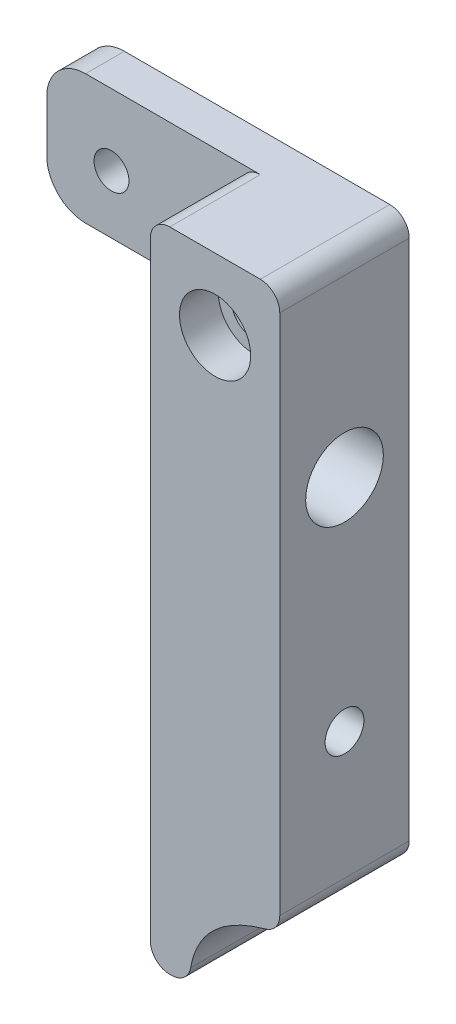
ISO-10303-21;
HEADER;
FILE_DESCRIPTION(('STEP AP214'),'2;1');
FILE_NAME('part.step','',(''),(''),'','','');
FILE_SCHEMA(('AUTOMOTIVE_DESIGN { 1 0 10303 214 1 1 1 1 }'));
ENDSEC;
DATA;
#1=APPLICATION_CONTEXT('core data for automotive mechanical design processes');
#2=APPLICATION_PROTOCOL_DEFINITION('international standard','automotive_design',2000,#1);
#3=PRODUCT_CONTEXT('',#1,'mechanical');
#4=PRODUCT('Part','Part','',(#3));
#5=PRODUCT_RELATED_PRODUCT_CATEGORY('part','',(#4));
#6=PRODUCT_DEFINITION_FORMATION('','',#4);
#7=PRODUCT_DEFINITION_CONTEXT('part definition',#1,'design');
#8=PRODUCT_DEFINITION('design','',#6,#7);
#9=PRODUCT_DEFINITION_SHAPE('','',#8);
#10=(LENGTH_UNIT() NAMED_UNIT(*) SI_UNIT(.MILLI.,.METRE.));
#11=(NAMED_UNIT(*) PLANE_ANGLE_UNIT() SI_UNIT($,.RADIAN.));
#12=(NAMED_UNIT(*) SI_UNIT($,.STERADIAN.) SOLID_ANGLE_UNIT());
#13=UNCERTAINTY_MEASURE_WITH_UNIT(LENGTH_MEASURE(1.E-05),#10,'distance_accuracy_value','');
#14=(GEOMETRIC_REPRESENTATION_CONTEXT(3) GLOBAL_UNCERTAINTY_ASSIGNED_CONTEXT((#13)) GLOBAL_UNIT_ASSIGNED_CONTEXT((#10,
#11,#12)) REPRESENTATION_CONTEXT('',''));
#15=CARTESIAN_POINT('',(0.,0.,0.));
#16=DIRECTION('',(0.,0.,1.));
#17=DIRECTION('',(1.,0.,0.));
#18=AXIS2_PLACEMENT_3D('',#15,#16,#17);
#19=CARTESIAN_POINT('',(-5.,25.,10.));
#20=DIRECTION('',(1.,0.,0.));
#21=DIRECTION('',(0.,1.,0.));
#22=AXIS2_PLACEMENT_3D('',#19,#20,#21);
#23=PLANE('',#22);
#24=CARTESIAN_POINT('',(-5.,-6.99999999999999,5.));
#25=DIRECTION('',(1.,0.,0.));
#26=DIRECTION('',(0.,1.,0.));
#27=AXIS2_PLACEMENT_3D('',#24,#25,#26);
#28=CIRCLE('',#27,1.5);
#29=CARTESIAN_POINT('',(-5.,-5.49999999999999,5.));
#30=VERTEX_POINT('',#29);
#31=EDGE_CURVE('E395',#30,#30,#28,.T.);
#32=ORIENTED_EDGE('',*,*,#31,.T.);
#33=EDGE_LOOP('',(#32));
#34=FACE_BOUND('',#33,.T.);
#35=CARTESIAN_POINT('',(-5.,10.,5.));
#36=DIRECTION('',(1.,0.,0.));
#37=DIRECTION('',(0.,1.,0.));
#38=AXIS2_PLACEMENT_3D('',#35,#36,#37);
#39=CIRCLE('',#38,3.);
#40=CARTESIAN_POINT('',(-5.,13.,5.));
#41=VERTEX_POINT('',#40);
#42=EDGE_CURVE('E184',#41,#41,#39,.T.);
#43=ORIENTED_EDGE('',*,*,#42,.T.);
#44=EDGE_LOOP('',(#43));
#45=FACE_BOUND('',#44,.T.);
#46=DIRECTION('',(0.,-1.,0.));
#47=VECTOR('',#46,1.);
#48=CARTESIAN_POINT('',(-5.,25.,10.));
#49=LINE('',#48,#47);
#50=CARTESIAN_POINT('',(-5.,23.5,10.));
#51=VERTEX_POINT('',#50);
#52=CARTESIAN_POINT('',(-5.,-23.5,10.));
#53=VERTEX_POINT('',#52);
#54=EDGE_CURVE('E292',#51,#53,#49,.T.);
#55=ORIENTED_EDGE('',*,*,#54,.F.);
#56=DIRECTION('',(0.,0.,-1.));
#57=VECTOR('',#56,1.);
#58=CARTESIAN_POINT('',(-5.,23.5,10.));
#59=LINE('',#58,#57);
#60=CARTESIAN_POINT('',(-5.,23.5,3.));
#61=VERTEX_POINT('',#60);
#62=EDGE_CURVE('E288',#51,#61,#59,.T.);
#63=ORIENTED_EDGE('',*,*,#62,.T.);
#64=DIRECTION('',(0.,1.,0.));
#65=VECTOR('',#64,1.);
#66=CARTESIAN_POINT('',(-5.,25.,3.));
#67=LINE('',#66,#65);
#68=CARTESIAN_POINT('',(-5.,15.,3.));
#69=VERTEX_POINT('',#68);
#70=EDGE_CURVE('E168',#69,#61,#67,.T.);
#71=ORIENTED_EDGE('',*,*,#70,.F.);
#72=DIRECTION('',(0.,0.,1.));
#73=VECTOR('',#72,1.);
#74=CARTESIAN_POINT('',(-5.,15.,0.));
#75=LINE('',#74,#73);
#76=CARTESIAN_POINT('',(-5.,15.,0.));
#77=VERTEX_POINT('',#76);
#78=EDGE_CURVE('E144',#77,#69,#75,.T.);
#79=ORIENTED_EDGE('',*,*,#78,.F.);
#80=DIRECTION('',(0.,-1.,0.));
#81=VECTOR('',#80,1.);
#82=CARTESIAN_POINT('',(-5.,25.,0.));
#83=LINE('',#82,#81);
#84=CARTESIAN_POINT('',(-5.,-23.5,0.));
#85=VERTEX_POINT('',#84);
#86=EDGE_CURVE('E153',#77,#85,#83,.T.);
#87=ORIENTED_EDGE('',*,*,#86,.T.);
#88=DIRECTION('',(0.,0.,-1.));
#89=VECTOR('',#88,1.);
#90=CARTESIAN_POINT('',(-5.,-23.5,10.));
#91=LINE('',#90,#89);
#92=EDGE_CURVE('E295',#85,#53,#91,.F.);
#93=ORIENTED_EDGE('',*,*,#92,.T.);
#94=EDGE_LOOP('',(#55,#63,#71,#79,#87,#93));
#95=FACE_BOUND('',#94,.T.);
#96=ADVANCED_FACE('F33',(#34,#45,#95),#23,.F.);
#97=CARTESIAN_POINT('',(0.,19.5,0.));
#98=DIRECTION('',(0.,0.,1.));
#99=DIRECTION('',(1.,0.,0.));
#100=AXIS2_PLACEMENT_3D('',#97,#98,#99);
#101=CYLINDRICAL_SURFACE('',#100,1.75);
#102=CARTESIAN_POINT('',(0.,19.5,0.));
#103=DIRECTION('',(0.,0.,1.));
#104=DIRECTION('',(1.,0.,0.));
#105=AXIS2_PLACEMENT_3D('',#102,#103,#104);
#106=CIRCLE('',#105,1.75);
#107=CARTESIAN_POINT('',(1.75,19.5,0.));
#108=VERTEX_POINT('',#107);
#109=EDGE_CURVE('E198',#108,#108,#106,.T.);
#110=ORIENTED_EDGE('',*,*,#109,.F.);
#111=EDGE_LOOP('',(#110));
#112=FACE_BOUND('',#111,.T.);
#113=CARTESIAN_POINT('',(0.,19.5,7.));
#114=DIRECTION('',(0.,0.,1.));
#115=DIRECTION('',(1.,0.,0.));
#116=AXIS2_PLACEMENT_3D('',#113,#114,#115);
#117=CIRCLE('',#116,1.75);
#118=CARTESIAN_POINT('',(1.75,19.5,7.));
#119=VERTEX_POINT('',#118);
#120=EDGE_CURVE('E188',#119,#119,#117,.F.);
#121=ORIENTED_EDGE('',*,*,#120,.F.);
#122=EDGE_LOOP('',(#121));
#123=FACE_BOUND('',#122,.T.);
#124=ADVANCED_FACE('F215',(#112,#123),#101,.F.);
#125=CARTESIAN_POINT('',(5.,25.,10.));
#126=DIRECTION('',(-1.,0.,0.));
#127=DIRECTION('',(0.,-1.,0.));
#128=AXIS2_PLACEMENT_3D('',#125,#126,#127);
#129=PLANE('',#128);
#130=CARTESIAN_POINT('',(5.,-6.99999999999999,5.));
#131=DIRECTION('',(1.,0.,0.));
#132=DIRECTION('',(0.,1.,0.));
#133=AXIS2_PLACEMENT_3D('',#130,#131,#132);
#134=CIRCLE('',#133,1.5);
#135=CARTESIAN_POINT('',(5.,-5.49999999999999,5.));
#136=VERTEX_POINT('',#135);
#137=EDGE_CURVE('E392',#136,#136,#134,.T.);
#138=ORIENTED_EDGE('',*,*,#137,.F.);
#139=EDGE_LOOP('',(#138));
#140=FACE_BOUND('',#139,.T.);
#141=CARTESIAN_POINT('',(5.,10.,5.));
#142=DIRECTION('',(1.,0.,0.));
#143=DIRECTION('',(0.,1.,0.));
#144=AXIS2_PLACEMENT_3D('',#141,#142,#143);
#145=CIRCLE('',#144,3.);
#146=CARTESIAN_POINT('',(5.,13.,5.));
#147=VERTEX_POINT('',#146);
#148=EDGE_CURVE('E149',#147,#147,#145,.T.);
#149=ORIENTED_EDGE('',*,*,#148,.F.);
#150=EDGE_LOOP('',(#149));
#151=FACE_BOUND('',#150,.T.);
#152=DIRECTION('',(0.,1.,0.));
#153=VECTOR('',#152,1.);
#154=CARTESIAN_POINT('',(5.,25.,10.));
#155=LINE('',#154,#153);
#156=CARTESIAN_POINT('',(5.,-16.8205775806911,10.));
#157=VERTEX_POINT('',#156);
#158=CARTESIAN_POINT('',(5.,23.5,10.));
#159=VERTEX_POINT('',#158);
#160=EDGE_CURVE('E346',#157,#159,#155,.T.);
#161=ORIENTED_EDGE('',*,*,#160,.F.);
#162=DIRECTION('',(0.,0.,1.));
#163=VECTOR('',#162,1.);
#164=CARTESIAN_POINT('',(5.,-16.8205775806911,10.));
#165=LINE('',#164,#163);
#166=CARTESIAN_POINT('',(5.,-16.8205775806911,0.));
#167=VERTEX_POINT('',#166);
#168=EDGE_CURVE('E328',#157,#167,#165,.F.);
#169=ORIENTED_EDGE('',*,*,#168,.T.);
#170=DIRECTION('',(0.,1.,0.));
#171=VECTOR('',#170,1.);
#172=CARTESIAN_POINT('',(5.,25.,0.));
#173=LINE('',#172,#171);
#174=CARTESIAN_POINT('',(5.,23.5,0.));
#175=VERTEX_POINT('',#174);
#176=EDGE_CURVE('E350',#167,#175,#173,.T.);
#177=ORIENTED_EDGE('',*,*,#176,.T.);
#178=DIRECTION('',(0.,0.,-1.));
#179=VECTOR('',#178,1.);
#180=CARTESIAN_POINT('',(5.,23.5,10.));
#181=LINE('',#180,#179);
#182=EDGE_CURVE('E330',#175,#159,#181,.F.);
#183=ORIENTED_EDGE('',*,*,#182,.T.);
#184=EDGE_LOOP('',(#161,#169,#177,#183));
#185=FACE_BOUND('',#184,.T.);
#186=ADVANCED_FACE('F218',(#140,#151,#185),#129,.F.);
#187=CARTESIAN_POINT('',(-5.,25.,10.));
#188=DIRECTION('',(0.,-1.,0.));
#189=DIRECTION('',(0.,0.,-1.));
#190=AXIS2_PLACEMENT_3D('',#187,#188,#189);
#191=PLANE('',#190);
#192=DIRECTION('',(1.,0.,0.));
#193=VECTOR('',#192,1.);
#194=CARTESIAN_POINT('',(-20.,25.,3.));
#195=LINE('',#194,#193);
#196=CARTESIAN_POINT('',(-17.,25.,3.));
#197=VERTEX_POINT('',#196);
#198=CARTESIAN_POINT('',(-3.5,25.,3.));
#199=VERTEX_POINT('',#198);
#200=EDGE_CURVE('E48',#197,#199,#195,.T.);
#201=ORIENTED_EDGE('',*,*,#200,.T.);
#202=DIRECTION('',(0.,0.,-1.));
#203=VECTOR('',#202,1.);
#204=CARTESIAN_POINT('',(-3.5,25.,10.));
#205=LINE('',#204,#203);
#206=CARTESIAN_POINT('',(-3.5,25.,10.));
#207=VERTEX_POINT('',#206);
#208=EDGE_CURVE('E52',#199,#207,#205,.F.);
#209=ORIENTED_EDGE('',*,*,#208,.T.);
#210=DIRECTION('',(-1.,0.,0.));
#211=VECTOR('',#210,1.);
#212=CARTESIAN_POINT('',(-5.,25.,10.));
#213=LINE('',#212,#211);
#214=CARTESIAN_POINT('',(3.5,25.,10.));
#215=VERTEX_POINT('',#214);
#216=EDGE_CURVE('E293',#215,#207,#213,.T.);
#217=ORIENTED_EDGE('',*,*,#216,.F.);
#218=DIRECTION('',(0.,0.,-1.));
#219=VECTOR('',#218,1.);
#220=CARTESIAN_POINT('',(3.5,25.,10.));
#221=LINE('',#220,#219);
#222=CARTESIAN_POINT('',(3.5,25.,0.));
#223=VERTEX_POINT('',#222);
#224=EDGE_CURVE('E306',#215,#223,#221,.T.);
#225=ORIENTED_EDGE('',*,*,#224,.T.);
#226=DIRECTION('',(-1.,0.,0.));
#227=VECTOR('',#226,1.);
#228=CARTESIAN_POINT('',(-5.,25.,0.));
#229=LINE('',#228,#227);
#230=CARTESIAN_POINT('',(-17.,25.,0.));
#231=VERTEX_POINT('',#230);
#232=EDGE_CURVE('E162',#223,#231,#229,.T.);
#233=ORIENTED_EDGE('',*,*,#232,.T.);
#234=DIRECTION('',(0.,0.,-1.));
#235=VECTOR('',#234,1.);
#236=CARTESIAN_POINT('',(-17.,25.,3.));
#237=LINE('',#236,#235);
#238=EDGE_CURVE('E276',#231,#197,#237,.F.);
#239=ORIENTED_EDGE('',*,*,#238,.T.);
#240=EDGE_LOOP('',(#201,#209,#217,#225,#233,#239));
#241=FACE_BOUND('',#240,.T.);
#242=ADVANCED_FACE('F230',(#241),#191,.F.);
#243=CARTESIAN_POINT('',(-5.,-25.,10.));
#244=DIRECTION('',(0.,1.,0.));
#245=DIRECTION('',(0.,0.,1.));
#246=AXIS2_PLACEMENT_3D('',#243,#244,#245);
#247=PLANE('',#246);
#248=DIRECTION('',(1.,0.,0.));
#249=VECTOR('',#248,1.);
#250=CARTESIAN_POINT('',(-5.,-25.,0.));
#251=LINE('',#250,#249);
#252=CARTESIAN_POINT('',(-3.5,-25.,0.));
#253=VERTEX_POINT('',#252);
#254=CARTESIAN_POINT('',(-3.36282393672585,-25.,0.));
#255=VERTEX_POINT('',#254);
#256=EDGE_CURVE('E161',#253,#255,#251,.T.);
#257=ORIENTED_EDGE('',*,*,#256,.T.);
#258=DIRECTION('',(0.,0.,1.));
#259=VECTOR('',#258,1.);
#260=CARTESIAN_POINT('',(-3.36282393672585,-25.,10.));
#261=LINE('',#260,#259);
#262=CARTESIAN_POINT('',(-3.36282393672585,-25.,10.));
#263=VERTEX_POINT('',#262);
#264=EDGE_CURVE('E315',#255,#263,#261,.T.);
#265=ORIENTED_EDGE('',*,*,#264,.T.);
#266=DIRECTION('',(1.,0.,0.));
#267=VECTOR('',#266,1.);
#268=CARTESIAN_POINT('',(-5.,-25.,10.));
#269=LINE('',#268,#267);
#270=CARTESIAN_POINT('',(-3.5,-25.,10.));
#271=VERTEX_POINT('',#270);
#272=EDGE_CURVE('E297',#271,#263,#269,.T.);
#273=ORIENTED_EDGE('',*,*,#272,.F.);
#274=DIRECTION('',(0.,0.,-1.));
#275=VECTOR('',#274,1.);
#276=CARTESIAN_POINT('',(-3.5,-25.,10.));
#277=LINE('',#276,#275);
#278=EDGE_CURVE('E318',#271,#253,#277,.T.);
#279=ORIENTED_EDGE('',*,*,#278,.T.);
#280=EDGE_LOOP('',(#257,#265,#273,#279));
#281=FACE_BOUND('',#280,.T.);
#282=ADVANCED_FACE('F223',(#281),#247,.F.);
#283=CARTESIAN_POINT('',(0.,0.,10.));
#284=DIRECTION('',(0.,0.,1.));
#285=DIRECTION('',(1.,0.,0.));
#286=AXIS2_PLACEMENT_3D('',#283,#284,#285);
#287=PLANE('',#286);
#288=CARTESIAN_POINT('',(0.,19.5,10.));
#289=DIRECTION('',(0.,0.,1.));
#290=DIRECTION('',(1.,0.,0.));
#291=AXIS2_PLACEMENT_3D('',#288,#289,#290);
#292=CIRCLE('',#291,2.75);
#293=CARTESIAN_POINT('',(2.75,19.5,10.));
#294=VERTEX_POINT('',#293);
#295=EDGE_CURVE('E189',#294,#294,#292,.T.);
#296=ORIENTED_EDGE('',*,*,#295,.F.);
#297=EDGE_LOOP('',(#296));
#298=FACE_BOUND('',#297,.T.);
#299=ORIENTED_EDGE('',*,*,#216,.T.);
#300=CARTESIAN_POINT('',(-3.5,23.5,10.));
#301=DIRECTION('',(0.,0.,1.));
#302=DIRECTION('',(1.,0.,0.));
#303=AXIS2_PLACEMENT_3D('',#300,#301,#302);
#304=CIRCLE('',#303,1.5);
#305=EDGE_CURVE('E41',#207,#51,#304,.T.);
#306=ORIENTED_EDGE('',*,*,#305,.T.);
#307=ORIENTED_EDGE('',*,*,#54,.T.);
#308=CARTESIAN_POINT('',(-3.5,-23.5,10.));
#309=DIRECTION('',(0.,0.,1.));
#310=DIRECTION('',(1.,0.,0.));
#311=AXIS2_PLACEMENT_3D('',#308,#309,#310);
#312=CIRCLE('',#311,1.5);
#313=EDGE_CURVE('E336',#53,#271,#312,.T.);
#314=ORIENTED_EDGE('',*,*,#313,.T.);
#315=ORIENTED_EDGE('',*,*,#272,.T.);
#316=CARTESIAN_POINT('',(-3.36282393672585,-23.5,10.));
#317=DIRECTION('',(0.,0.,1.));
#318=DIRECTION('',(1.,0.,0.));
#319=AXIS2_PLACEMENT_3D('',#316,#317,#318);
#320=CIRCLE('',#319,1.5);
#321=CARTESIAN_POINT('',(-1.88522685811019,-23.7582767377571,10.));
#322=VERTEX_POINT('',#321);
#323=EDGE_CURVE('E334',#263,#322,#320,.T.);
#324=ORIENTED_EDGE('',*,*,#323,.T.);
#325=CARTESIAN_POINT('',(5.,-18.,10.));
#326=CARTESIAN_POINT('',(-1.90422484156133,-19.4309354552699,10.));
#327=CARTESIAN_POINT('',(-2.,-25.,10.));
#328=B_SPLINE_CURVE_WITH_KNOTS('',2,(#325,#326,#327),.UNSPECIFIED.,.F.,.F.,(3,3),(0.,1.),.UNSPECIFIED.);
#329=CARTESIAN_POINT('',(3.90400517645005,-18.2651466574062,10.));
#330=VERTEX_POINT('',#329);
#331=EDGE_CURVE('E199',#330,#322,#328,.T.);
#332=ORIENTED_EDGE('',*,*,#331,.F.);
#333=CARTESIAN_POINT('',(3.5,-16.8205775806911,10.));
#334=DIRECTION('',(0.,0.,1.));
#335=DIRECTION('',(1.,0.,0.));
#336=AXIS2_PLACEMENT_3D('',#333,#334,#335);
#337=CIRCLE('',#336,1.5);
#338=EDGE_CURVE('E332',#330,#157,#337,.T.);
#339=ORIENTED_EDGE('',*,*,#338,.T.);
#340=ORIENTED_EDGE('',*,*,#160,.T.);
#341=CARTESIAN_POINT('',(3.5,23.5,10.));
#342=DIRECTION('',(0.,0.,1.));
#343=DIRECTION('',(1.,0.,0.));
#344=AXIS2_PLACEMENT_3D('',#341,#342,#343);
#345=CIRCLE('',#344,1.5);
#346=EDGE_CURVE('E338',#159,#215,#345,.T.);
#347=ORIENTED_EDGE('',*,*,#346,.T.);
#348=EDGE_LOOP('',(#299,#306,#307,#314,#315,#324,#332,#339,#340,#347));
#349=FACE_BOUND('',#348,.T.);
#350=ADVANCED_FACE('F220',(#298,#349),#287,.T.);
#351=CARTESIAN_POINT('',(0.,0.,0.));
#352=DIRECTION('',(0.,0.,1.));
#353=DIRECTION('',(1.,0.,0.));
#354=AXIS2_PLACEMENT_3D('',#351,#352,#353);
#355=PLANE('',#354);
#356=CARTESIAN_POINT('',(-15.,19.5,0.));
#357=DIRECTION('',(0.,0.,1.));
#358=DIRECTION('',(1.,0.,0.));
#359=AXIS2_PLACEMENT_3D('',#356,#357,#358);
#360=CIRCLE('',#359,1.35);
#361=CARTESIAN_POINT('',(-13.65,19.5,0.));
#362=VERTEX_POINT('',#361);
#363=EDGE_CURVE('E169',#362,#362,#360,.T.);
#364=ORIENTED_EDGE('',*,*,#363,.T.);
#365=EDGE_LOOP('',(#364));
#366=FACE_BOUND('',#365,.T.);
#367=ORIENTED_EDGE('',*,*,#109,.T.);
#368=EDGE_LOOP('',(#367));
#369=FACE_BOUND('',#368,.T.);
#370=DIRECTION('',(0.,-1.,0.));
#371=VECTOR('',#370,1.);
#372=CARTESIAN_POINT('',(-20.,25.,0.));
#373=LINE('',#372,#371);
#374=CARTESIAN_POINT('',(-20.,22.,0.));
#375=VERTEX_POINT('',#374);
#376=CARTESIAN_POINT('',(-20.,18.,0.));
#377=VERTEX_POINT('',#376);
#378=EDGE_CURVE('E171',#375,#377,#373,.T.);
#379=ORIENTED_EDGE('',*,*,#378,.F.);
#380=CARTESIAN_POINT('',(-17.,22.,0.));
#381=DIRECTION('',(0.,0.,1.));
#382=DIRECTION('',(1.,0.,0.));
#383=AXIS2_PLACEMENT_3D('',#380,#381,#382);
#384=CIRCLE('',#383,3.);
#385=EDGE_CURVE('E273',#375,#231,#384,.F.);
#386=ORIENTED_EDGE('',*,*,#385,.T.);
#387=ORIENTED_EDGE('',*,*,#232,.F.);
#388=CARTESIAN_POINT('',(3.5,23.5,0.));
#389=DIRECTION('',(0.,0.,1.));
#390=DIRECTION('',(1.,0.,0.));
#391=AXIS2_PLACEMENT_3D('',#388,#389,#390);
#392=CIRCLE('',#391,1.5);
#393=EDGE_CURVE('E326',#223,#175,#392,.F.);
#394=ORIENTED_EDGE('',*,*,#393,.T.);
#395=ORIENTED_EDGE('',*,*,#176,.F.);
#396=CARTESIAN_POINT('',(3.5,-16.8205775806911,0.));
#397=DIRECTION('',(0.,0.,1.));
#398=DIRECTION('',(1.,0.,0.));
#399=AXIS2_PLACEMENT_3D('',#396,#397,#398);
#400=CIRCLE('',#399,1.5);
#401=CARTESIAN_POINT('',(3.90400517645005,-18.2651466574062,0.));
#402=VERTEX_POINT('',#401);
#403=EDGE_CURVE('E321',#167,#402,#400,.F.);
#404=ORIENTED_EDGE('',*,*,#403,.T.);
#405=CARTESIAN_POINT('',(5.,-18.,0.));
#406=CARTESIAN_POINT('',(-1.90422484156133,-19.4309354552699,0.));
#407=CARTESIAN_POINT('',(-2.,-25.,0.));
#408=B_SPLINE_CURVE_WITH_KNOTS('',2,(#405,#406,#407),.UNSPECIFIED.,.F.,.F.,(3,3),(0.,1.),.UNSPECIFIED.);
#409=CARTESIAN_POINT('',(-1.88522685811019,-23.7582767377571,0.));
#410=VERTEX_POINT('',#409);
#411=EDGE_CURVE('E192',#402,#410,#408,.T.);
#412=ORIENTED_EDGE('',*,*,#411,.T.);
#413=CARTESIAN_POINT('',(-3.36282393672585,-23.5,0.));
#414=DIRECTION('',(0.,0.,1.));
#415=DIRECTION('',(1.,0.,0.));
#416=AXIS2_PLACEMENT_3D('',#413,#414,#415);
#417=CIRCLE('',#416,1.5);
#418=EDGE_CURVE('E323',#410,#255,#417,.F.);
#419=ORIENTED_EDGE('',*,*,#418,.T.);
#420=ORIENTED_EDGE('',*,*,#256,.F.);
#421=CARTESIAN_POINT('',(-3.5,-23.5,0.));
#422=DIRECTION('',(0.,0.,1.));
#423=DIRECTION('',(1.,0.,0.));
#424=AXIS2_PLACEMENT_3D('',#421,#422,#423);
#425=CIRCLE('',#424,1.5);
#426=EDGE_CURVE('E157',#253,#85,#425,.F.);
#427=ORIENTED_EDGE('',*,*,#426,.T.);
#428=ORIENTED_EDGE('',*,*,#86,.F.);
#429=DIRECTION('',(1.,0.,0.));
#430=VECTOR('',#429,1.);
#431=CARTESIAN_POINT('',(-20.,15.,0.));
#432=LINE('',#431,#430);
#433=CARTESIAN_POINT('',(-17.,15.,0.));
#434=VERTEX_POINT('',#433);
#435=EDGE_CURVE('E139',#434,#77,#432,.T.);
#436=ORIENTED_EDGE('',*,*,#435,.F.);
#437=CARTESIAN_POINT('',(-17.,18.,0.));
#438=DIRECTION('',(0.,0.,1.));
#439=DIRECTION('',(1.,0.,0.));
#440=AXIS2_PLACEMENT_3D('',#437,#438,#439);
#441=CIRCLE('',#440,3.);
#442=EDGE_CURVE('E269',#434,#377,#441,.F.);
#443=ORIENTED_EDGE('',*,*,#442,.T.);
#444=EDGE_LOOP('',(#379,#386,#387,#394,#395,#404,#412,#419,#420,#427,#428,#436,#443));
#445=FACE_BOUND('',#444,.T.);
#446=ADVANCED_FACE('F155',(#366,#369,#445),#355,.F.);
#447=DIRECTION('',(0.,0.,1.));
#448=VECTOR('',#447,1.);
#449=SURFACE_OF_LINEAR_EXTRUSION('',#408,#448);
#450=ORIENTED_EDGE('',*,*,#411,.F.);
#451=DIRECTION('',(0.,0.,1.));
#452=VECTOR('',#451,1.);
#453=CARTESIAN_POINT('',(3.90400517645005,-18.2651466574062,0.));
#454=LINE('',#453,#452);
#455=EDGE_CURVE('E340',#402,#330,#454,.T.);
#456=ORIENTED_EDGE('',*,*,#455,.T.);
#457=ORIENTED_EDGE('',*,*,#331,.T.);
#458=DIRECTION('',(0.,0.,1.));
#459=VECTOR('',#458,1.);
#460=CARTESIAN_POINT('',(-1.88522685811019,-23.7582767377571,10.));
#461=LINE('',#460,#459);
#462=EDGE_CURVE('E343',#322,#410,#461,.F.);
#463=ORIENTED_EDGE('',*,*,#462,.T.);
#464=EDGE_LOOP('',(#450,#456,#457,#463));
#465=FACE_BOUND('',#464,.T.);
#466=ADVANCED_FACE('F207',(#465),#449,.F.);
#467=CARTESIAN_POINT('',(3.5,-16.8205775806911,5.));
#468=DIRECTION('',(0.,0.,1.));
#469=DIRECTION('',(1.,0.,0.));
#470=AXIS2_PLACEMENT_3D('',#467,#468,#469);
#471=CYLINDRICAL_SURFACE('',#470,1.5);
#472=ORIENTED_EDGE('',*,*,#403,.F.);
#473=ORIENTED_EDGE('',*,*,#168,.F.);
#474=ORIENTED_EDGE('',*,*,#338,.F.);
#475=ORIENTED_EDGE('',*,*,#455,.F.);
#476=EDGE_LOOP('',(#472,#473,#474,#475));
#477=FACE_BOUND('',#476,.T.);
#478=ADVANCED_FACE('F211',(#477),#471,.T.);
#479=CARTESIAN_POINT('',(-3.36282393672585,-23.5,5.));
#480=DIRECTION('',(0.,0.,1.));
#481=DIRECTION('',(1.,0.,0.));
#482=AXIS2_PLACEMENT_3D('',#479,#480,#481);
#483=CYLINDRICAL_SURFACE('',#482,1.5);
#484=ORIENTED_EDGE('',*,*,#418,.F.);
#485=ORIENTED_EDGE('',*,*,#462,.F.);
#486=ORIENTED_EDGE('',*,*,#323,.F.);
#487=ORIENTED_EDGE('',*,*,#264,.F.);
#488=EDGE_LOOP('',(#484,#485,#486,#487));
#489=FACE_BOUND('',#488,.T.);
#490=ADVANCED_FACE('F242',(#489),#483,.T.);
#491=CARTESIAN_POINT('',(-3.5,-23.5,10.));
#492=DIRECTION('',(0.,0.,-1.));
#493=DIRECTION('',(-1.,0.,0.));
#494=AXIS2_PLACEMENT_3D('',#491,#492,#493);
#495=CYLINDRICAL_SURFACE('',#494,1.5);
#496=ORIENTED_EDGE('',*,*,#313,.F.);
#497=ORIENTED_EDGE('',*,*,#92,.F.);
#498=ORIENTED_EDGE('',*,*,#426,.F.);
#499=ORIENTED_EDGE('',*,*,#278,.F.);
#500=EDGE_LOOP('',(#496,#497,#498,#499));
#501=FACE_BOUND('',#500,.T.);
#502=ADVANCED_FACE('F246',(#501),#495,.T.);
#503=CARTESIAN_POINT('',(3.5,23.5,10.));
#504=DIRECTION('',(0.,0.,-1.));
#505=DIRECTION('',(-1.,0.,0.));
#506=AXIS2_PLACEMENT_3D('',#503,#504,#505);
#507=CYLINDRICAL_SURFACE('',#506,1.5);
#508=ORIENTED_EDGE('',*,*,#346,.F.);
#509=ORIENTED_EDGE('',*,*,#182,.F.);
#510=ORIENTED_EDGE('',*,*,#393,.F.);
#511=ORIENTED_EDGE('',*,*,#224,.F.);
#512=EDGE_LOOP('',(#508,#509,#510,#511));
#513=FACE_BOUND('',#512,.T.);
#514=ADVANCED_FACE('F250',(#513),#507,.T.);
#515=CARTESIAN_POINT('',(0.,19.5,7.));
#516=DIRECTION('',(0.,0.,1.));
#517=DIRECTION('',(1.,0.,0.));
#518=AXIS2_PLACEMENT_3D('',#515,#516,#517);
#519=PLANE('',#518);
#520=CARTESIAN_POINT('',(0.,19.5,7.));
#521=DIRECTION('',(0.,0.,1.));
#522=DIRECTION('',(1.,0.,0.));
#523=AXIS2_PLACEMENT_3D('',#520,#521,#522);
#524=CIRCLE('',#523,2.75);
#525=CARTESIAN_POINT('',(2.75,19.5,7.));
#526=VERTEX_POINT('',#525);
#527=EDGE_CURVE('E185',#526,#526,#524,.T.);
#528=ORIENTED_EDGE('',*,*,#527,.T.);
#529=EDGE_LOOP('',(#528));
#530=FACE_BOUND('',#529,.T.);
#531=ORIENTED_EDGE('',*,*,#120,.T.);
#532=EDGE_LOOP('',(#531));
#533=FACE_BOUND('',#532,.T.);
#534=ADVANCED_FACE('F254',(#530,#533),#519,.T.);
#535=CARTESIAN_POINT('',(0.,19.5,7.));
#536=DIRECTION('',(0.,0.,1.));
#537=DIRECTION('',(1.,0.,0.));
#538=AXIS2_PLACEMENT_3D('',#535,#536,#537);
#539=CYLINDRICAL_SURFACE('',#538,2.75);
#540=ORIENTED_EDGE('',*,*,#527,.F.);
#541=EDGE_LOOP('',(#540));
#542=FACE_BOUND('',#541,.T.);
#543=ORIENTED_EDGE('',*,*,#295,.T.);
#544=EDGE_LOOP('',(#543));
#545=FACE_BOUND('',#544,.T.);
#546=ADVANCED_FACE('F213',(#542,#545),#539,.F.);
#547=CARTESIAN_POINT('',(-8.,10.,5.));
#548=DIRECTION('',(1.,0.,0.));
#549=DIRECTION('',(0.,1.,0.));
#550=AXIS2_PLACEMENT_3D('',#547,#548,#549);
#551=CYLINDRICAL_SURFACE('',#550,3.);
#552=ORIENTED_EDGE('',*,*,#148,.T.);
#553=EDGE_LOOP('',(#552));
#554=FACE_BOUND('',#553,.T.);
#555=ORIENTED_EDGE('',*,*,#42,.F.);
#556=EDGE_LOOP('',(#555));
#557=FACE_BOUND('',#556,.T.);
#558=ADVANCED_FACE('F368',(#554,#557),#551,.F.);
#559=CARTESIAN_POINT('',(-20.,15.,0.));
#560=DIRECTION('',(0.,1.,0.));
#561=DIRECTION('',(-1.,0.,0.));
#562=AXIS2_PLACEMENT_3D('',#559,#560,#561);
#563=PLANE('',#562);
#564=DIRECTION('',(1.,0.,0.));
#565=VECTOR('',#564,1.);
#566=CARTESIAN_POINT('',(-20.,15.,3.));
#567=LINE('',#566,#565);
#568=CARTESIAN_POINT('',(-17.,15.,3.));
#569=VERTEX_POINT('',#568);
#570=EDGE_CURVE('E150',#569,#69,#567,.T.);
#571=ORIENTED_EDGE('',*,*,#570,.F.);
#572=DIRECTION('',(0.,0.,1.));
#573=VECTOR('',#572,1.);
#574=CARTESIAN_POINT('',(-17.,15.,0.));
#575=LINE('',#574,#573);
#576=EDGE_CURVE('E146',#569,#434,#575,.F.);
#577=ORIENTED_EDGE('',*,*,#576,.T.);
#578=ORIENTED_EDGE('',*,*,#435,.T.);
#579=ORIENTED_EDGE('',*,*,#78,.T.);
#580=EDGE_LOOP('',(#571,#577,#578,#579));
#581=FACE_BOUND('',#580,.T.);
#582=ADVANCED_FACE('F142',(#581),#563,.F.);
#583=CARTESIAN_POINT('',(-20.,25.,3.));
#584=DIRECTION('',(0.,0.,-1.));
#585=DIRECTION('',(0.,1.,0.));
#586=AXIS2_PLACEMENT_3D('',#583,#584,#585);
#587=PLANE('',#586);
#588=CARTESIAN_POINT('',(-15.,19.5,3.));
#589=DIRECTION('',(0.,0.,1.));
#590=DIRECTION('',(1.,0.,0.));
#591=AXIS2_PLACEMENT_3D('',#588,#589,#590);
#592=CIRCLE('',#591,1.35);
#593=CARTESIAN_POINT('',(-13.65,19.5,3.));
#594=VERTEX_POINT('',#593);
#595=EDGE_CURVE('E174',#594,#594,#592,.T.);
#596=ORIENTED_EDGE('',*,*,#595,.F.);
#597=EDGE_LOOP('',(#596));
#598=FACE_BOUND('',#597,.T.);
#599=ORIENTED_EDGE('',*,*,#200,.F.);
#600=CARTESIAN_POINT('',(-17.,22.,3.));
#601=DIRECTION('',(0.,0.,-1.));
#602=DIRECTION('',(0.,1.,0.));
#603=AXIS2_PLACEMENT_3D('',#600,#601,#602);
#604=CIRCLE('',#603,3.);
#605=CARTESIAN_POINT('',(-20.,22.,3.));
#606=VERTEX_POINT('',#605);
#607=EDGE_CURVE('E285',#197,#606,#604,.F.);
#608=ORIENTED_EDGE('',*,*,#607,.T.);
#609=DIRECTION('',(0.,1.,0.));
#610=VECTOR('',#609,1.);
#611=CARTESIAN_POINT('',(-20.,25.,3.));
#612=LINE('',#611,#610);
#613=CARTESIAN_POINT('',(-20.,18.,3.));
#614=VERTEX_POINT('',#613);
#615=EDGE_CURVE('E177',#614,#606,#612,.T.);
#616=ORIENTED_EDGE('',*,*,#615,.F.);
#617=CARTESIAN_POINT('',(-17.,18.,3.));
#618=DIRECTION('',(0.,0.,-1.));
#619=DIRECTION('',(0.,1.,0.));
#620=AXIS2_PLACEMENT_3D('',#617,#618,#619);
#621=CIRCLE('',#620,3.);
#622=EDGE_CURVE('E283',#614,#569,#621,.F.);
#623=ORIENTED_EDGE('',*,*,#622,.T.);
#624=ORIENTED_EDGE('',*,*,#570,.T.);
#625=ORIENTED_EDGE('',*,*,#70,.T.);
#626=CARTESIAN_POINT('',(-3.5,23.5,3.));
#627=DIRECTION('',(0.,0.,-1.));
#628=DIRECTION('',(0.,1.,0.));
#629=AXIS2_PLACEMENT_3D('',#626,#627,#628);
#630=CIRCLE('',#629,1.5);
#631=EDGE_CURVE('E11',#61,#199,#630,.T.);
#632=ORIENTED_EDGE('',*,*,#631,.T.);
#633=EDGE_LOOP('',(#599,#608,#616,#623,#624,#625,#632));
#634=FACE_BOUND('',#633,.T.);
#635=ADVANCED_FACE('F300',(#598,#634),#587,.F.);
#636=CARTESIAN_POINT('',(-20.,0.,0.));
#637=DIRECTION('',(-1.,0.,0.));
#638=DIRECTION('',(0.,-1.,0.));
#639=AXIS2_PLACEMENT_3D('',#636,#637,#638);
#640=PLANE('',#639);
#641=ORIENTED_EDGE('',*,*,#615,.T.);
#642=DIRECTION('',(0.,0.,-1.));
#643=VECTOR('',#642,1.);
#644=CARTESIAN_POINT('',(-20.,22.,0.));
#645=LINE('',#644,#643);
#646=EDGE_CURVE('E274',#606,#375,#645,.T.);
#647=ORIENTED_EDGE('',*,*,#646,.T.);
#648=ORIENTED_EDGE('',*,*,#378,.T.);
#649=DIRECTION('',(0.,0.,1.));
#650=VECTOR('',#649,1.);
#651=CARTESIAN_POINT('',(-20.,18.,3.));
#652=LINE('',#651,#650);
#653=EDGE_CURVE('E271',#377,#614,#652,.T.);
#654=ORIENTED_EDGE('',*,*,#653,.T.);
#655=EDGE_LOOP('',(#641,#647,#648,#654));
#656=FACE_BOUND('',#655,.T.);
#657=ADVANCED_FACE('F259',(#656),#640,.T.);
#658=CARTESIAN_POINT('',(-17.,22.,0.));
#659=DIRECTION('',(0.,0.,1.));
#660=DIRECTION('',(1.,0.,0.));
#661=AXIS2_PLACEMENT_3D('',#658,#659,#660);
#662=CYLINDRICAL_SURFACE('',#661,3.);
#663=ORIENTED_EDGE('',*,*,#607,.F.);
#664=ORIENTED_EDGE('',*,*,#238,.F.);
#665=ORIENTED_EDGE('',*,*,#385,.F.);
#666=ORIENTED_EDGE('',*,*,#646,.F.);
#667=EDGE_LOOP('',(#663,#664,#665,#666));
#668=FACE_BOUND('',#667,.T.);
#669=ADVANCED_FACE('F256',(#668),#662,.T.);
#670=CARTESIAN_POINT('',(-17.,18.,0.));
#671=DIRECTION('',(0.,0.,-1.));
#672=DIRECTION('',(-1.,0.,0.));
#673=AXIS2_PLACEMENT_3D('',#670,#671,#672);
#674=CYLINDRICAL_SURFACE('',#673,3.);
#675=ORIENTED_EDGE('',*,*,#442,.F.);
#676=ORIENTED_EDGE('',*,*,#576,.F.);
#677=ORIENTED_EDGE('',*,*,#622,.F.);
#678=ORIENTED_EDGE('',*,*,#653,.F.);
#679=EDGE_LOOP('',(#675,#676,#677,#678));
#680=FACE_BOUND('',#679,.T.);
#681=ADVANCED_FACE('F258',(#680),#674,.T.);
#682=CARTESIAN_POINT('',(-3.5,23.5,10.));
#683=DIRECTION('',(0.,0.,-1.));
#684=DIRECTION('',(-1.,0.,0.));
#685=AXIS2_PLACEMENT_3D('',#682,#683,#684);
#686=CYLINDRICAL_SURFACE('',#685,1.5);
#687=ORIENTED_EDGE('',*,*,#305,.F.);
#688=ORIENTED_EDGE('',*,*,#208,.F.);
#689=ORIENTED_EDGE('',*,*,#631,.F.);
#690=ORIENTED_EDGE('',*,*,#62,.F.);
#691=EDGE_LOOP('',(#687,#688,#689,#690));
#692=FACE_BOUND('',#691,.T.);
#693=ADVANCED_FACE('F35',(#692),#686,.T.);
#694=CARTESIAN_POINT('',(-15.,19.5,-12.));
#695=DIRECTION('',(0.,0.,1.));
#696=DIRECTION('',(1.,0.,0.));
#697=AXIS2_PLACEMENT_3D('',#694,#695,#696);
#698=CYLINDRICAL_SURFACE('',#697,1.35);
#699=ORIENTED_EDGE('',*,*,#595,.T.);
#700=EDGE_LOOP('',(#699));
#701=FACE_BOUND('',#700,.T.);
#702=ORIENTED_EDGE('',*,*,#363,.F.);
#703=EDGE_LOOP('',(#702));
#704=FACE_BOUND('',#703,.T.);
#705=ADVANCED_FACE('F266',(#701,#704),#698,.F.);
#706=CARTESIAN_POINT('',(-10.,-6.99999999999999,5.));
#707=DIRECTION('',(1.,0.,0.));
#708=DIRECTION('',(0.,1.,0.));
#709=AXIS2_PLACEMENT_3D('',#706,#707,#708);
#710=CYLINDRICAL_SURFACE('',#709,1.5);
#711=ORIENTED_EDGE('',*,*,#137,.T.);
#712=EDGE_LOOP('',(#711));
#713=FACE_BOUND('',#712,.T.);
#714=ORIENTED_EDGE('',*,*,#31,.F.);
#715=EDGE_LOOP('',(#714));
#716=FACE_BOUND('',#715,.T.);
#717=ADVANCED_FACE('F383',(#713,#716),#710,.F.);
#718=CLOSED_SHELL('',(#96,#124,#186,#242,#282,#350,#446,#466,#478,#490,#502,#514,#534,#546,#558,
#582,#635,#657,#669,#681,#693,#705,#717));
#719=MANIFOLD_SOLID_BREP('B2',#718);
#720=ADVANCED_BREP_SHAPE_REPRESENTATION('',(#18,#719),#14);
#721=SHAPE_DEFINITION_REPRESENTATION(#9,#720);
ENDSEC;
END-ISO-10303-21;
